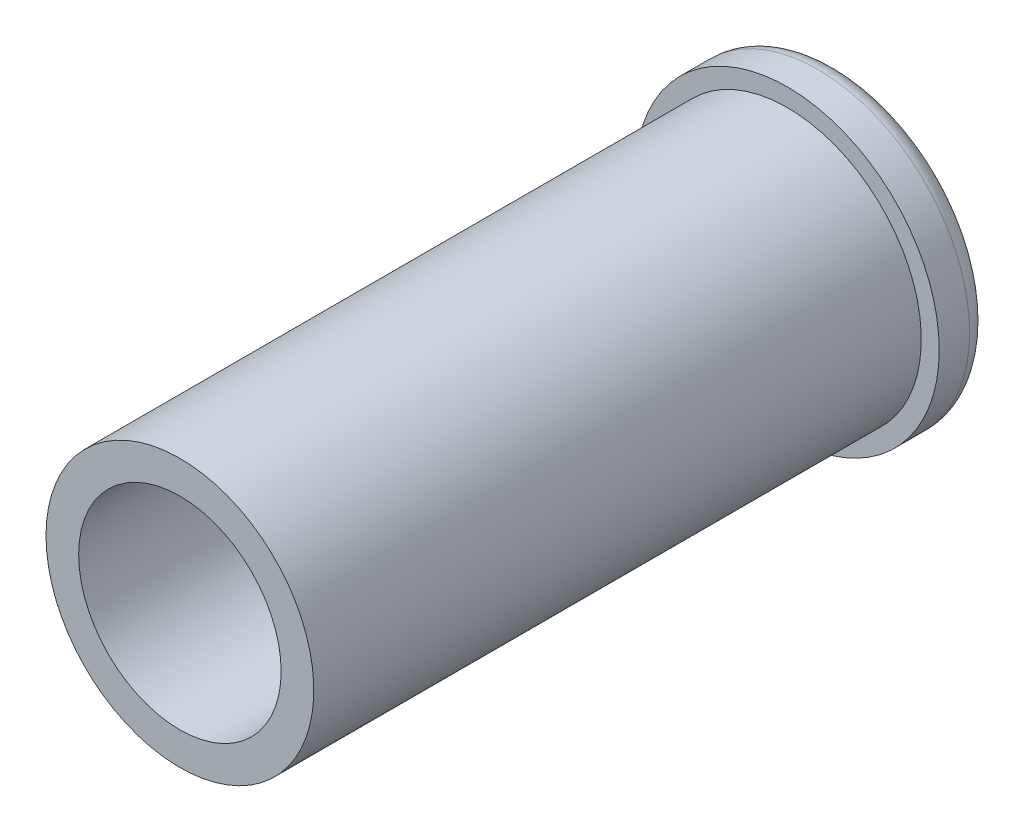
ISO-10303-21;
HEADER;
FILE_DESCRIPTION(('STEP AP214'),'2;1');
FILE_NAME('part.step','',(''),(''),'','','');
FILE_SCHEMA(('AUTOMOTIVE_DESIGN { 1 0 10303 214 1 1 1 1 }'));
ENDSEC;
DATA;
#1=APPLICATION_CONTEXT('core data for automotive mechanical design processes');
#2=APPLICATION_PROTOCOL_DEFINITION('international standard','automotive_design',2000,#1);
#3=PRODUCT_CONTEXT('',#1,'mechanical');
#4=PRODUCT('Part','Part','',(#3));
#5=PRODUCT_RELATED_PRODUCT_CATEGORY('part','',(#4));
#6=PRODUCT_DEFINITION_FORMATION('','',#4);
#7=PRODUCT_DEFINITION_CONTEXT('part definition',#1,'design');
#8=PRODUCT_DEFINITION('design','',#6,#7);
#9=PRODUCT_DEFINITION_SHAPE('','',#8);
#10=(LENGTH_UNIT() NAMED_UNIT(*) SI_UNIT(.MILLI.,.METRE.));
#11=(NAMED_UNIT(*) PLANE_ANGLE_UNIT() SI_UNIT($,.RADIAN.));
#12=(NAMED_UNIT(*) SI_UNIT($,.STERADIAN.) SOLID_ANGLE_UNIT());
#13=UNCERTAINTY_MEASURE_WITH_UNIT(LENGTH_MEASURE(1.E-05),#10,'distance_accuracy_value','');
#14=(GEOMETRIC_REPRESENTATION_CONTEXT(3) GLOBAL_UNCERTAINTY_ASSIGNED_CONTEXT((#13)) GLOBAL_UNIT_ASSIGNED_CONTEXT((#10,
#11,#12)) REPRESENTATION_CONTEXT('',''));
#15=CARTESIAN_POINT('',(0.,0.,0.));
#16=DIRECTION('',(0.,0.,1.));
#17=DIRECTION('',(1.,0.,0.));
#18=AXIS2_PLACEMENT_3D('',#15,#16,#17);
#19=CARTESIAN_POINT('',(0.,0.,22.2250000000001));
#20=DIRECTION('',(0.,0.,1.));
#21=DIRECTION('',(1.,0.,0.));
#22=AXIS2_PLACEMENT_3D('',#19,#20,#21);
#23=CYLINDRICAL_SURFACE('',#22,9.525);
#24=CARTESIAN_POINT('',(0.,0.,23.4950000000001));
#25=DIRECTION('',(0.,0.,1.));
#26=DIRECTION('',(1.,0.,0.));
#27=AXIS2_PLACEMENT_3D('',#24,#25,#26);
#28=CIRCLE('',#27,9.525);
#29=CARTESIAN_POINT('',(9.525,0.,23.4950000000001));
#30=VERTEX_POINT('',#29);
#31=EDGE_CURVE('E81',#30,#30,#28,.T.);
#32=ORIENTED_EDGE('',*,*,#31,.T.);
#33=EDGE_LOOP('',(#32));
#34=FACE_BOUND('',#33,.T.);
#35=CARTESIAN_POINT('',(0.,0.,25.4000000000001));
#36=DIRECTION('',(0.,0.,1.));
#37=DIRECTION('',(1.,0.,0.));
#38=AXIS2_PLACEMENT_3D('',#35,#36,#37);
#39=CIRCLE('',#38,9.525);
#40=CARTESIAN_POINT('',(9.525,0.,25.4000000000001));
#41=VERTEX_POINT('',#40);
#42=EDGE_CURVE('E88',#41,#41,#39,.T.);
#43=ORIENTED_EDGE('',*,*,#42,.F.);
#44=EDGE_LOOP('',(#43));
#45=FACE_BOUND('',#44,.T.);
#46=ADVANCED_FACE('F63',(#34,#45),#23,.T.);
#47=CARTESIAN_POINT('',(0.,0.,25.4000000000001));
#48=DIRECTION('',(0.,0.,1.));
#49=DIRECTION('',(1.,0.,0.));
#50=AXIS2_PLACEMENT_3D('',#47,#48,#49);
#51=PLANE('',#50);
#52=CARTESIAN_POINT('',(0.,0.,25.4000000000001));
#53=DIRECTION('',(0.,0.,1.));
#54=DIRECTION('',(1.,0.,0.));
#55=AXIS2_PLACEMENT_3D('',#52,#53,#54);
#56=CIRCLE('',#55,8.39799999999995);
#57=CARTESIAN_POINT('',(-8.39799999999996,0.,25.4000000000001));
#58=VERTEX_POINT('',#57);
#59=EDGE_CURVE('E87',#58,#58,#56,.T.);
#60=ORIENTED_EDGE('',*,*,#59,.F.);
#61=EDGE_LOOP('',(#60));
#62=FACE_BOUND('',#61,.T.);
#63=ORIENTED_EDGE('',*,*,#42,.T.);
#64=EDGE_LOOP('',(#63));
#65=FACE_BOUND('',#64,.T.);
#66=ADVANCED_FACE('F119',(#62,#65),#51,.T.);
#67=CARTESIAN_POINT('',(0.,0.,22.2250000000001));
#68=DIRECTION('',(0.,0.,1.));
#69=DIRECTION('',(1.,0.,0.));
#70=AXIS2_PLACEMENT_3D('',#67,#68,#69);
#71=PLANE('',#70);
#72=CARTESIAN_POINT('',(0.,0.,22.2250000000001));
#73=DIRECTION('',(0.,0.,1.));
#74=DIRECTION('',(1.,0.,0.));
#75=AXIS2_PLACEMENT_3D('',#72,#73,#74);
#76=CIRCLE('',#75,8.255);
#77=CARTESIAN_POINT('',(8.255,0.,22.2250000000001));
#78=VERTEX_POINT('',#77);
#79=EDGE_CURVE('E71',#78,#78,#76,.F.);
#80=ORIENTED_EDGE('',*,*,#79,.T.);
#81=EDGE_LOOP('',(#80));
#82=FACE_BOUND('',#81,.T.);
#83=CARTESIAN_POINT('',(0.,0.,22.2250000000001));
#84=DIRECTION('',(0.,0.,1.));
#85=DIRECTION('',(1.,0.,0.));
#86=AXIS2_PLACEMENT_3D('',#83,#84,#85);
#87=CIRCLE('',#86,7.62);
#88=CARTESIAN_POINT('',(7.62,0.,22.2250000000001));
#89=VERTEX_POINT('',#88);
#90=EDGE_CURVE('E76',#89,#89,#87,.T.);
#91=ORIENTED_EDGE('',*,*,#90,.T.);
#92=EDGE_LOOP('',(#91));
#93=FACE_BOUND('',#92,.T.);
#94=ADVANCED_FACE('F122',(#82,#93),#71,.F.);
#95=CARTESIAN_POINT('',(0.,0.,22.2250000000001));
#96=DIRECTION('',(0.,0.,1.));
#97=DIRECTION('',(1.,0.,0.));
#98=AXIS2_PLACEMENT_3D('',#95,#96,#97);
#99=CYLINDRICAL_SURFACE('',#98,6.35);
#100=CARTESIAN_POINT('',(0.,0.,23.4950000000001));
#101=DIRECTION('',(0.,0.,1.));
#102=DIRECTION('',(1.,0.,0.));
#103=AXIS2_PLACEMENT_3D('',#100,#101,#102);
#104=CIRCLE('',#103,6.35);
#105=CARTESIAN_POINT('',(6.35,0.,23.4950000000001));
#106=VERTEX_POINT('',#105);
#107=EDGE_CURVE('E11',#106,#106,#104,.F.);
#108=ORIENTED_EDGE('',*,*,#107,.T.);
#109=EDGE_LOOP('',(#108));
#110=FACE_BOUND('',#109,.T.);
#111=CARTESIAN_POINT('',(0.,0.,63.5000000000001));
#112=DIRECTION('',(0.,0.,1.));
#113=DIRECTION('',(1.,0.,0.));
#114=AXIS2_PLACEMENT_3D('',#111,#112,#113);
#115=CIRCLE('',#114,6.35);
#116=CARTESIAN_POINT('',(6.35,0.,63.5000000000001));
#117=VERTEX_POINT('',#116);
#118=EDGE_CURVE('E99',#117,#117,#115,.T.);
#119=ORIENTED_EDGE('',*,*,#118,.T.);
#120=EDGE_LOOP('',(#119));
#121=FACE_BOUND('',#120,.T.);
#122=ADVANCED_FACE('F104',(#110,#121),#99,.F.);
#123=CARTESIAN_POINT('',(0.,0.,63.5000000000001));
#124=DIRECTION('',(0.,0.,-1.));
#125=DIRECTION('',(-1.,0.,0.));
#126=AXIS2_PLACEMENT_3D('',#123,#124,#125);
#127=CYLINDRICAL_SURFACE('',#126,8.39799999999995);
#128=CARTESIAN_POINT('',(0.,0.,63.5000000000001));
#129=DIRECTION('',(0.,0.,1.));
#130=DIRECTION('',(1.,0.,0.));
#131=AXIS2_PLACEMENT_3D('',#128,#129,#130);
#132=CIRCLE('',#131,8.39799999999995);
#133=CARTESIAN_POINT('',(-8.39799999999996,0.,63.5000000000001));
#134=VERTEX_POINT('',#133);
#135=EDGE_CURVE('E92',#134,#134,#132,.T.);
#136=CARTESIAN_POINT('',(-8.39799999999996,0.,63.5000000000001));
#137=CARTESIAN_POINT('',(-8.39799999999996,0.,63.1031250000001));
#138=CARTESIAN_POINT('',(-8.39799999999996,0.,62.7062500000001));
#139=CARTESIAN_POINT('',(-8.39799999999996,0.,61.9125000000001));
#140=CARTESIAN_POINT('',(-8.39799999999996,0.,61.5156250000001));
#141=CARTESIAN_POINT('',(-8.39799999999996,0.,60.7218750000001));
#142=CARTESIAN_POINT('',(-8.39799999999996,0.,60.3250000000001));
#143=CARTESIAN_POINT('',(-8.39799999999996,0.,59.5312500000001));
#144=CARTESIAN_POINT('',(-8.39799999999996,0.,59.1343750000001));
#145=CARTESIAN_POINT('',(-8.39799999999996,0.,58.3406250000001));
#146=CARTESIAN_POINT('',(-8.39799999999996,0.,57.9437500000001));
#147=CARTESIAN_POINT('',(-8.39799999999996,0.,57.1500000000001));
#148=CARTESIAN_POINT('',(-8.39799999999996,0.,56.7531250000001));
#149=CARTESIAN_POINT('',(-8.39799999999996,0.,55.9593750000001));
#150=CARTESIAN_POINT('',(-8.39799999999996,0.,55.5625000000001));
#151=CARTESIAN_POINT('',(-8.39799999999996,0.,54.7687500000001));
#152=CARTESIAN_POINT('',(-8.39799999999996,0.,54.3718750000001));
#153=CARTESIAN_POINT('',(-8.39799999999996,0.,53.5781250000001));
#154=CARTESIAN_POINT('',(-8.39799999999996,0.,53.1812500000001));
#155=CARTESIAN_POINT('',(-8.39799999999996,0.,52.3875000000001));
#156=CARTESIAN_POINT('',(-8.39799999999996,0.,51.9906250000001));
#157=CARTESIAN_POINT('',(-8.39799999999996,0.,51.1968750000001));
#158=CARTESIAN_POINT('',(-8.39799999999996,0.,50.8000000000001));
#159=CARTESIAN_POINT('',(-8.39799999999996,0.,50.0062500000001));
#160=CARTESIAN_POINT('',(-8.39799999999996,0.,49.6093750000001));
#161=CARTESIAN_POINT('',(-8.39799999999996,0.,48.8156250000001));
#162=CARTESIAN_POINT('',(-8.39799999999996,0.,48.4187500000001));
#163=CARTESIAN_POINT('',(-8.39799999999996,0.,47.6250000000001));
#164=CARTESIAN_POINT('',(-8.39799999999996,0.,47.2281250000001));
#165=CARTESIAN_POINT('',(-8.39799999999996,0.,46.4343750000001));
#166=CARTESIAN_POINT('',(-8.39799999999996,0.,46.0375000000001));
#167=CARTESIAN_POINT('',(-8.39799999999996,0.,45.2437500000001));
#168=CARTESIAN_POINT('',(-8.39799999999996,0.,44.8468750000001));
#169=CARTESIAN_POINT('',(-8.39799999999996,0.,44.0531250000001));
#170=CARTESIAN_POINT('',(-8.39799999999996,0.,43.6562500000001));
#171=CARTESIAN_POINT('',(-8.39799999999996,0.,42.8625000000001));
#172=CARTESIAN_POINT('',(-8.39799999999996,0.,42.4656250000001));
#173=CARTESIAN_POINT('',(-8.39799999999996,0.,41.6718750000001));
#174=CARTESIAN_POINT('',(-8.39799999999996,0.,41.2750000000001));
#175=CARTESIAN_POINT('',(-8.39799999999996,0.,40.4812500000001));
#176=CARTESIAN_POINT('',(-8.39799999999996,0.,40.0843750000001));
#177=CARTESIAN_POINT('',(-8.39799999999996,0.,39.2906250000001));
#178=CARTESIAN_POINT('',(-8.39799999999996,0.,38.8937500000001));
#179=CARTESIAN_POINT('',(-8.39799999999996,0.,38.1000000000001));
#180=CARTESIAN_POINT('',(-8.39799999999996,0.,37.7031250000001));
#181=CARTESIAN_POINT('',(-8.39799999999996,0.,36.9093750000001));
#182=CARTESIAN_POINT('',(-8.39799999999996,0.,36.5125000000001));
#183=CARTESIAN_POINT('',(-8.39799999999996,0.,35.7187500000001));
#184=CARTESIAN_POINT('',(-8.39799999999996,0.,35.3218750000001));
#185=CARTESIAN_POINT('',(-8.39799999999996,0.,34.5281250000001));
#186=CARTESIAN_POINT('',(-8.39799999999996,0.,34.1312500000001));
#187=CARTESIAN_POINT('',(-8.39799999999996,0.,33.3375000000001));
#188=CARTESIAN_POINT('',(-8.39799999999996,0.,32.9406250000001));
#189=CARTESIAN_POINT('',(-8.39799999999996,0.,32.1468750000001));
#190=CARTESIAN_POINT('',(-8.39799999999996,0.,31.7500000000001));
#191=CARTESIAN_POINT('',(-8.39799999999996,0.,30.9562500000001));
#192=CARTESIAN_POINT('',(-8.39799999999996,0.,30.5593750000001));
#193=CARTESIAN_POINT('',(-8.39799999999996,0.,29.7656250000001));
#194=CARTESIAN_POINT('',(-8.39799999999996,0.,29.3687500000001));
#195=CARTESIAN_POINT('',(-8.39799999999996,0.,28.5750000000001));
#196=CARTESIAN_POINT('',(-8.39799999999996,0.,28.1781250000001));
#197=CARTESIAN_POINT('',(-8.39799999999996,0.,27.3843750000001));
#198=CARTESIAN_POINT('',(-8.39799999999996,0.,26.9875000000001));
#199=CARTESIAN_POINT('',(-8.39799999999996,0.,26.1937500000001));
#200=CARTESIAN_POINT('',(-8.39799999999996,0.,25.7968750000001));
#201=CARTESIAN_POINT('',(-8.39799999999996,0.,25.4000000000001));
#202=B_SPLINE_CURVE_WITH_KNOTS('',3,(#136,#137,#138,#139,#140,#141,#142,#143,#144,#145,#146,
#147,#148,#149,#150,#151,#152,#153,#154,#155,#156,#157,#158,#159,#160,#161,#162,#163,#164,#165,
#166,#167,#168,#169,#170,#171,#172,#173,#174,#175,#176,#177,#178,#179,#180,#181,#182,#183,#184,
#185,#186,#187,#188,#189,#190,#191,#192,#193,#194,#195,#196,#197,#198,#199,#200,#201),
.UNSPECIFIED.,.F.,.F.,(4,2,2,2,2,2,2,2,2,2,2,2,2,2,2,2,2,2,2,2,2,2,2,2,2,2,2,2,2,2,2,2,4),(0.,
1.19062500000001,2.38125000000001,3.57187500000001,4.7625,5.953125,7.14375,8.334375,
9.52500000000001,10.715625,11.90625,13.096875,14.2875,15.478125,16.66875,17.859375,19.05,
20.240625,21.43125,22.621875,23.8125,25.003125,26.19375,27.384375,28.575,29.765625,30.95625,
32.146875,33.3375,34.528125,35.71875,36.909375,38.1),.UNSPECIFIED.);
#203=EDGE_CURVE('BSEAM110',#134,#58,#202,.T.);
#204=ORIENTED_EDGE('',*,*,#135,.F.);
#205=ORIENTED_EDGE('',*,*,#59,.T.);
#206=ORIENTED_EDGE('',*,*,#203,.T.);
#207=ORIENTED_EDGE('',*,*,#203,.F.);
#208=EDGE_LOOP('',(#204,#206,#205,#207));
#209=FACE_BOUND('',#208,.T.);
#210=ADVANCED_FACE('F110',(#209),#127,.T.);
#211=CARTESIAN_POINT('',(0.,0.,63.5000000000001));
#212=DIRECTION('',(0.,0.,1.));
#213=DIRECTION('',(1.,0.,0.));
#214=AXIS2_PLACEMENT_3D('',#211,#212,#213);
#215=PLANE('',#214);
#216=ORIENTED_EDGE('',*,*,#118,.F.);
#217=EDGE_LOOP('',(#216));
#218=FACE_BOUND('',#217,.T.);
#219=ORIENTED_EDGE('',*,*,#135,.T.);
#220=EDGE_LOOP('',(#219));
#221=FACE_BOUND('',#220,.T.);
#222=ADVANCED_FACE('F106',(#218,#221),#215,.T.);
#223=CARTESIAN_POINT('',(0.,0.,23.4950000000001));
#224=DIRECTION('',(0.,0.,1.));
#225=DIRECTION('',(1.,0.,0.));
#226=AXIS2_PLACEMENT_3D('',#223,#224,#225);
#227=TOROIDAL_SURFACE('',#226,8.255,1.27);
#228=ORIENTED_EDGE('',*,*,#79,.F.);
#229=EDGE_LOOP('',(#228));
#230=FACE_BOUND('',#229,.T.);
#231=ORIENTED_EDGE('',*,*,#31,.F.);
#232=EDGE_LOOP('',(#231));
#233=FACE_BOUND('',#232,.T.);
#234=ADVANCED_FACE('F109',(#230,#233),#227,.T.);
#235=CARTESIAN_POINT('',(0.,0.,23.4950000000001));
#236=DIRECTION('',(0.,0.,1.));
#237=DIRECTION('',(1.,0.,0.));
#238=AXIS2_PLACEMENT_3D('',#235,#236,#237);
#239=TOROIDAL_SURFACE('',#238,7.62,1.27);
#240=ORIENTED_EDGE('',*,*,#107,.F.);
#241=EDGE_LOOP('',(#240));
#242=FACE_BOUND('',#241,.T.);
#243=ORIENTED_EDGE('',*,*,#90,.F.);
#244=EDGE_LOOP('',(#243));
#245=FACE_BOUND('',#244,.T.);
#246=ADVANCED_FACE('F65',(#242,#245),#239,.T.);
#247=CLOSED_SHELL('',(#46,#66,#94,#122,#210,#222,#234,#246));
#248=MANIFOLD_SOLID_BREP('B2',#247);
#249=ADVANCED_BREP_SHAPE_REPRESENTATION('',(#18,#248),#14);
#250=SHAPE_DEFINITION_REPRESENTATION(#9,#249);
ENDSEC;
END-ISO-10303-21;
